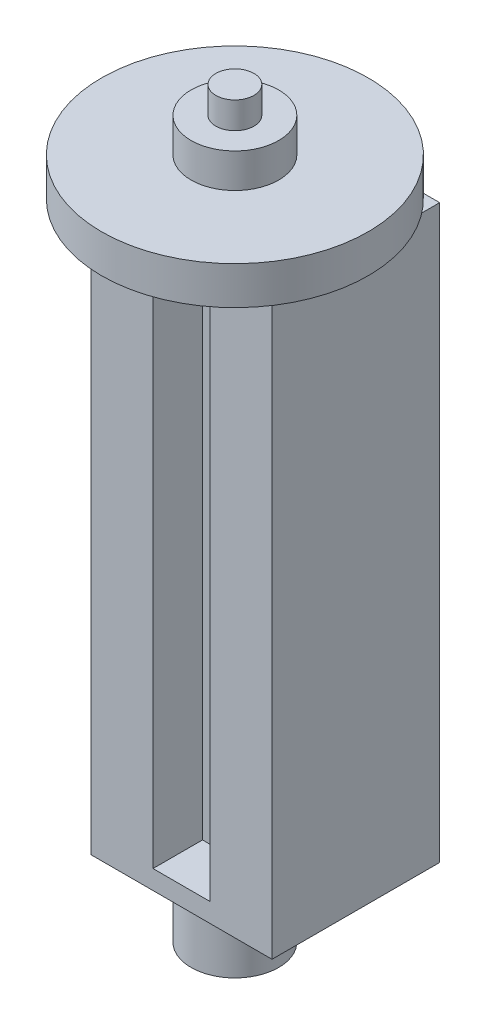
ISO-10303-21;
HEADER;
FILE_DESCRIPTION(('STEP AP214'),'2;1');
FILE_NAME('part.step','',(''),(''),'','','');
FILE_SCHEMA(('AUTOMOTIVE_DESIGN { 1 0 10303 214 1 1 1 1 }'));
ENDSEC;
DATA;
#1=APPLICATION_CONTEXT('core data for automotive mechanical design processes');
#2=APPLICATION_PROTOCOL_DEFINITION('international standard','automotive_design',2000,#1);
#3=PRODUCT_CONTEXT('',#1,'mechanical');
#4=PRODUCT('Part','Part','',(#3));
#5=PRODUCT_RELATED_PRODUCT_CATEGORY('part','',(#4));
#6=PRODUCT_DEFINITION_FORMATION('','',#4);
#7=PRODUCT_DEFINITION_CONTEXT('part definition',#1,'design');
#8=PRODUCT_DEFINITION('design','',#6,#7);
#9=PRODUCT_DEFINITION_SHAPE('','',#8);
#10=(LENGTH_UNIT() NAMED_UNIT(*) SI_UNIT(.MILLI.,.METRE.));
#11=(NAMED_UNIT(*) PLANE_ANGLE_UNIT() SI_UNIT($,.RADIAN.));
#12=(NAMED_UNIT(*) SI_UNIT($,.STERADIAN.) SOLID_ANGLE_UNIT());
#13=UNCERTAINTY_MEASURE_WITH_UNIT(LENGTH_MEASURE(1.E-05),#10,'distance_accuracy_value','');
#14=(GEOMETRIC_REPRESENTATION_CONTEXT(3) GLOBAL_UNCERTAINTY_ASSIGNED_CONTEXT((#13)) GLOBAL_UNIT_ASSIGNED_CONTEXT((#10,
#11,#12)) REPRESENTATION_CONTEXT('',''));
#15=CARTESIAN_POINT('',(0.,0.,0.));
#16=DIRECTION('',(0.,0.,1.));
#17=DIRECTION('',(1.,0.,0.));
#18=AXIS2_PLACEMENT_3D('',#15,#16,#17);
#19=CARTESIAN_POINT('',(0.,16.7526911934581,3.));
#20=DIRECTION('',(0.,-1.,0.));
#21=DIRECTION('',(0.,0.,-1.));
#22=AXIS2_PLACEMENT_3D('',#19,#20,#21);
#23=CYLINDRICAL_SURFACE('',#22,1.15);
#24=CARTESIAN_POINT('',(0.,8.90000000000001,3.));
#25=DIRECTION('',(0.,1.,0.));
#26=DIRECTION('',(0.,0.,1.));
#27=AXIS2_PLACEMENT_3D('',#24,#25,#26);
#28=CIRCLE('',#27,1.15);
#29=CARTESIAN_POINT('',(0.,8.90000000000001,4.15));
#30=VERTEX_POINT('',#29);
#31=EDGE_CURVE('E12',#30,#30,#28,.F.);
#32=ORIENTED_EDGE('',*,*,#31,.F.);
#33=EDGE_LOOP('',(#32));
#34=FACE_BOUND('',#33,.T.);
#35=CARTESIAN_POINT('',(0.,9.80000000000001,3.));
#36=DIRECTION('',(0.,1.,0.));
#37=DIRECTION('',(0.,0.,1.));
#38=AXIS2_PLACEMENT_3D('',#35,#36,#37);
#39=CIRCLE('',#38,1.15);
#40=CARTESIAN_POINT('',(0.,9.80000000000001,4.15));
#41=VERTEX_POINT('',#40);
#42=EDGE_CURVE('E152',#41,#41,#39,.T.);
#43=ORIENTED_EDGE('',*,*,#42,.F.);
#44=EDGE_LOOP('',(#43));
#45=FACE_BOUND('',#44,.T.);
#46=ADVANCED_FACE('F36',(#34,#45),#23,.T.);
#47=CARTESIAN_POINT('',(0.,7.50000000000001,3.));
#48=DIRECTION('',(0.,1.,0.));
#49=DIRECTION('',(0.,0.,1.));
#50=AXIS2_PLACEMENT_3D('',#47,#48,#49);
#51=CIRCLE('',#50,1.15);
#52=CARTESIAN_POINT('',(0.,7.50000000000001,4.15));
#53=VERTEX_POINT('',#52);
#54=EDGE_CURVE('E45',#53,#53,#51,.T.);
#55=ORIENTED_EDGE('',*,*,#54,.T.);
#56=EDGE_LOOP('',(#55));
#57=FACE_BOUND('',#56,.T.);
#58=CARTESIAN_POINT('',(0.,7.9,3.));
#59=DIRECTION('',(0.,1.,0.));
#60=DIRECTION('',(0.,0.,1.));
#61=AXIS2_PLACEMENT_3D('',#58,#59,#60);
#62=CIRCLE('',#61,1.15);
#63=CARTESIAN_POINT('',(0.,7.9,4.15));
#64=VERTEX_POINT('',#63);
#65=EDGE_CURVE('E40',#64,#64,#62,.F.);
#66=ORIENTED_EDGE('',*,*,#65,.T.);
#67=EDGE_LOOP('',(#66));
#68=FACE_BOUND('',#67,.T.);
#69=ADVANCED_FACE('F207',(#57,#68),#23,.T.);
#70=CARTESIAN_POINT('',(-2.37500000000001,7.50000000000001,4.4));
#71=DIRECTION('',(0.,1.,0.));
#72=DIRECTION('',(0.,0.,1.));
#73=AXIS2_PLACEMENT_3D('',#70,#71,#72);
#74=PLANE('',#73);
#75=ORIENTED_EDGE('',*,*,#54,.F.);
#76=EDGE_LOOP('',(#75));
#77=FACE_BOUND('',#76,.T.);
#78=DIRECTION('',(1.,0.,0.));
#79=VECTOR('',#78,1.);
#80=CARTESIAN_POINT('',(-2.37500000000001,7.50000000000001,0.));
#81=LINE('',#80,#79);
#82=CARTESIAN_POINT('',(-2.37500000000001,7.50000000000001,0.));
#83=VERTEX_POINT('',#82);
#84=CARTESIAN_POINT('',(2.375,7.50000000000001,0.));
#85=VERTEX_POINT('',#84);
#86=EDGE_CURVE('E178',#83,#85,#81,.T.);
#87=ORIENTED_EDGE('',*,*,#86,.F.);
#88=DIRECTION('',(0.,0.,-1.));
#89=VECTOR('',#88,1.);
#90=CARTESIAN_POINT('',(-2.37500000000001,7.50000000000001,4.4));
#91=LINE('',#90,#89);
#92=CARTESIAN_POINT('',(-2.37500000000001,7.50000000000001,4.4));
#93=VERTEX_POINT('',#92);
#94=EDGE_CURVE('E61',#93,#83,#91,.T.);
#95=ORIENTED_EDGE('',*,*,#94,.F.);
#96=DIRECTION('',(1.,0.,0.));
#97=VECTOR('',#96,1.);
#98=CARTESIAN_POINT('',(-2.37500000000001,7.50000000000001,4.4));
#99=LINE('',#98,#97);
#100=CARTESIAN_POINT('',(2.375,7.50000000000001,4.4));
#101=VERTEX_POINT('',#100);
#102=EDGE_CURVE('E169',#93,#101,#99,.T.);
#103=ORIENTED_EDGE('',*,*,#102,.T.);
#104=DIRECTION('',(0.,0.,-1.));
#105=VECTOR('',#104,1.);
#106=CARTESIAN_POINT('',(2.375,7.50000000000001,4.4));
#107=LINE('',#106,#105);
#108=EDGE_CURVE('E86',#101,#85,#107,.T.);
#109=ORIENTED_EDGE('',*,*,#108,.T.);
#110=EDGE_LOOP('',(#87,#95,#103,#109));
#111=FACE_BOUND('',#110,.T.);
#112=ADVANCED_FACE('F38',(#77,#111),#74,.T.);
#113=CARTESIAN_POINT('',(-2.37500000000001,7.50000000000001,4.4));
#114=DIRECTION('',(1.,0.,0.));
#115=DIRECTION('',(0.,0.,-1.));
#116=AXIS2_PLACEMENT_3D('',#113,#114,#115);
#117=PLANE('',#116);
#118=DIRECTION('',(0.,-1.,0.));
#119=VECTOR('',#118,1.);
#120=CARTESIAN_POINT('',(-2.37500000000001,7.50000000000001,0.));
#121=LINE('',#120,#119);
#122=CARTESIAN_POINT('',(-2.37500000000001,-7.49999999999999,0.));
#123=VERTEX_POINT('',#122);
#124=EDGE_CURVE('E172',#83,#123,#121,.T.);
#125=ORIENTED_EDGE('',*,*,#124,.T.);
#126=DIRECTION('',(0.,0.,-1.));
#127=VECTOR('',#126,1.);
#128=CARTESIAN_POINT('',(-2.37500000000001,-7.49999999999999,4.4));
#129=LINE('',#128,#127);
#130=CARTESIAN_POINT('',(-2.37500000000001,-7.49999999999999,4.4));
#131=VERTEX_POINT('',#130);
#132=EDGE_CURVE('E189',#131,#123,#129,.T.);
#133=ORIENTED_EDGE('',*,*,#132,.F.);
#134=DIRECTION('',(0.,-1.,0.));
#135=VECTOR('',#134,1.);
#136=CARTESIAN_POINT('',(-2.37500000000001,7.50000000000001,4.4));
#137=LINE('',#136,#135);
#138=EDGE_CURVE('E176',#93,#131,#137,.T.);
#139=ORIENTED_EDGE('',*,*,#138,.F.);
#140=ORIENTED_EDGE('',*,*,#94,.T.);
#141=EDGE_LOOP('',(#125,#133,#139,#140));
#142=FACE_BOUND('',#141,.T.);
#143=ADVANCED_FACE('F227',(#142),#117,.F.);
#144=CARTESIAN_POINT('',(-2.37500000000001,-7.49999999999999,4.4));
#145=DIRECTION('',(0.,1.,0.));
#146=DIRECTION('',(0.,0.,1.));
#147=AXIS2_PLACEMENT_3D('',#144,#145,#146);
#148=PLANE('',#147);
#149=CARTESIAN_POINT('',(0.,-7.49999999999999,3.));
#150=DIRECTION('',(0.,1.,0.));
#151=DIRECTION('',(0.,0.,1.));
#152=AXIS2_PLACEMENT_3D('',#149,#150,#151);
#153=CIRCLE('',#152,1.15);
#154=CARTESIAN_POINT('',(0.,-7.49999999999999,4.15));
#155=VERTEX_POINT('',#154);
#156=EDGE_CURVE('E166',#155,#155,#153,.T.);
#157=ORIENTED_EDGE('',*,*,#156,.T.);
#158=EDGE_LOOP('',(#157));
#159=FACE_BOUND('',#158,.T.);
#160=DIRECTION('',(1.,0.,0.));
#161=VECTOR('',#160,1.);
#162=CARTESIAN_POINT('',(-2.37500000000001,-7.49999999999999,0.));
#163=LINE('',#162,#161);
#164=CARTESIAN_POINT('',(2.375,-7.49999999999999,0.));
#165=VERTEX_POINT('',#164);
#166=EDGE_CURVE('E184',#123,#165,#163,.T.);
#167=ORIENTED_EDGE('',*,*,#166,.T.);
#168=DIRECTION('',(0.,0.,-1.));
#169=VECTOR('',#168,1.);
#170=CARTESIAN_POINT('',(2.375,-7.49999999999999,4.4));
#171=LINE('',#170,#169);
#172=CARTESIAN_POINT('',(2.375,-7.49999999999999,4.4));
#173=VERTEX_POINT('',#172);
#174=EDGE_CURVE('E192',#173,#165,#171,.T.);
#175=ORIENTED_EDGE('',*,*,#174,.F.);
#176=DIRECTION('',(1.,0.,0.));
#177=VECTOR('',#176,1.);
#178=CARTESIAN_POINT('',(-2.37500000000001,-7.49999999999999,4.4));
#179=LINE('',#178,#177);
#180=EDGE_CURVE('E174',#131,#173,#179,.T.);
#181=ORIENTED_EDGE('',*,*,#180,.F.);
#182=ORIENTED_EDGE('',*,*,#132,.T.);
#183=EDGE_LOOP('',(#167,#175,#181,#182));
#184=FACE_BOUND('',#183,.T.);
#185=ADVANCED_FACE('F198',(#159,#184),#148,.F.);
#186=CARTESIAN_POINT('',(2.375,7.50000000000001,4.4));
#187=DIRECTION('',(1.,0.,0.));
#188=DIRECTION('',(0.,1.,0.));
#189=AXIS2_PLACEMENT_3D('',#186,#187,#188);
#190=PLANE('',#189);
#191=DIRECTION('',(0.,-1.,0.));
#192=VECTOR('',#191,1.);
#193=CARTESIAN_POINT('',(2.375,7.50000000000001,0.));
#194=LINE('',#193,#192);
#195=EDGE_CURVE('E181',#85,#165,#194,.T.);
#196=ORIENTED_EDGE('',*,*,#195,.F.);
#197=ORIENTED_EDGE('',*,*,#108,.F.);
#198=DIRECTION('',(0.,-1.,0.));
#199=VECTOR('',#198,1.);
#200=CARTESIAN_POINT('',(2.375,7.50000000000001,4.4));
#201=LINE('',#200,#199);
#202=EDGE_CURVE('E171',#101,#173,#201,.T.);
#203=ORIENTED_EDGE('',*,*,#202,.T.);
#204=ORIENTED_EDGE('',*,*,#174,.T.);
#205=EDGE_LOOP('',(#196,#197,#203,#204));
#206=FACE_BOUND('',#205,.T.);
#207=ADVANCED_FACE('F352',(#206),#190,.T.);
#208=CARTESIAN_POINT('',(0.,0.,4.4));
#209=DIRECTION('',(0.,0.,-1.));
#210=DIRECTION('',(-1.,0.,0.));
#211=AXIS2_PLACEMENT_3D('',#208,#209,#210);
#212=PLANE('',#211);
#213=DIRECTION('',(-1.,0.,0.));
#214=VECTOR('',#213,1.);
#215=CARTESIAN_POINT('',(-0.750000000000001,7.,4.4));
#216=LINE('',#215,#214);
#217=CARTESIAN_POINT('',(0.749999999999999,7.,4.4));
#218=VERTEX_POINT('',#217);
#219=CARTESIAN_POINT('',(-0.750000000000001,7.,4.4));
#220=VERTEX_POINT('',#219);
#221=EDGE_CURVE('E139',#218,#220,#216,.T.);
#222=ORIENTED_EDGE('',*,*,#221,.F.);
#223=DIRECTION('',(0.,1.,0.));
#224=VECTOR('',#223,1.);
#225=CARTESIAN_POINT('',(0.749999999999999,7.,4.4));
#226=LINE('',#225,#224);
#227=CARTESIAN_POINT('',(0.750000000000001,-7.,4.4));
#228=VERTEX_POINT('',#227);
#229=EDGE_CURVE('E52',#228,#218,#226,.T.);
#230=ORIENTED_EDGE('',*,*,#229,.F.);
#231=DIRECTION('',(1.,0.,0.));
#232=VECTOR('',#231,1.);
#233=CARTESIAN_POINT('',(-0.749999999999999,-7.,4.4));
#234=LINE('',#233,#232);
#235=CARTESIAN_POINT('',(-0.749999999999999,-7.,4.4));
#236=VERTEX_POINT('',#235);
#237=EDGE_CURVE('E130',#236,#228,#234,.T.);
#238=ORIENTED_EDGE('',*,*,#237,.F.);
#239=DIRECTION('',(0.,-1.,0.));
#240=VECTOR('',#239,1.);
#241=CARTESIAN_POINT('',(-0.750000000000001,7.,4.4));
#242=LINE('',#241,#240);
#243=EDGE_CURVE('E133',#220,#236,#242,.T.);
#244=ORIENTED_EDGE('',*,*,#243,.F.);
#245=EDGE_LOOP('',(#222,#230,#238,#244));
#246=FACE_BOUND('',#245,.T.);
#247=ORIENTED_EDGE('',*,*,#102,.F.);
#248=ORIENTED_EDGE('',*,*,#138,.T.);
#249=ORIENTED_EDGE('',*,*,#180,.T.);
#250=ORIENTED_EDGE('',*,*,#202,.F.);
#251=EDGE_LOOP('',(#247,#248,#249,#250));
#252=FACE_BOUND('',#251,.T.);
#253=ADVANCED_FACE('F369',(#246,#252),#212,.F.);
#254=CARTESIAN_POINT('',(0.,0.,0.));
#255=DIRECTION('',(0.,0.,-1.));
#256=DIRECTION('',(-1.,0.,0.));
#257=AXIS2_PLACEMENT_3D('',#254,#255,#256);
#258=PLANE('',#257);
#259=ORIENTED_EDGE('',*,*,#86,.T.);
#260=ORIENTED_EDGE('',*,*,#195,.T.);
#261=ORIENTED_EDGE('',*,*,#166,.F.);
#262=ORIENTED_EDGE('',*,*,#124,.F.);
#263=EDGE_LOOP('',(#259,#260,#261,#262));
#264=FACE_BOUND('',#263,.T.);
#265=ADVANCED_FACE('F215',(#264),#258,.T.);
#266=CARTESIAN_POINT('',(0.,-8.99999999999999,3.));
#267=DIRECTION('',(0.,-1.,0.));
#268=DIRECTION('',(0.,0.,-1.));
#269=AXIS2_PLACEMENT_3D('',#266,#267,#268);
#270=PLANE('',#269);
#271=CARTESIAN_POINT('',(0.,-8.99999999999999,3.));
#272=DIRECTION('',(0.,-1.,0.));
#273=DIRECTION('',(0.,0.,-1.));
#274=AXIS2_PLACEMENT_3D('',#271,#272,#273);
#275=CIRCLE('',#274,1.15);
#276=CARTESIAN_POINT('',(0.,-8.99999999999999,1.85));
#277=VERTEX_POINT('',#276);
#278=EDGE_CURVE('E163',#277,#277,#275,.T.);
#279=ORIENTED_EDGE('',*,*,#278,.T.);
#280=EDGE_LOOP('',(#279));
#281=FACE_BOUND('',#280,.T.);
#282=ADVANCED_FACE('F204',(#281),#270,.T.);
#283=ORIENTED_EDGE('',*,*,#278,.F.);
#284=EDGE_LOOP('',(#283));
#285=FACE_BOUND('',#284,.T.);
#286=ORIENTED_EDGE('',*,*,#156,.F.);
#287=EDGE_LOOP('',(#286));
#288=FACE_BOUND('',#287,.T.);
#289=ADVANCED_FACE('F201',(#285,#288),#23,.T.);
#290=CARTESIAN_POINT('',(0.,7.9,3.));
#291=DIRECTION('',(0.,1.,0.));
#292=DIRECTION('',(0.,0.,1.));
#293=AXIS2_PLACEMENT_3D('',#290,#291,#292);
#294=CYLINDRICAL_SURFACE('',#293,3.5);
#295=CARTESIAN_POINT('',(0.,7.9,3.));
#296=DIRECTION('',(0.,1.,0.));
#297=DIRECTION('',(0.,0.,1.));
#298=AXIS2_PLACEMENT_3D('',#295,#296,#297);
#299=CIRCLE('',#298,3.5);
#300=CARTESIAN_POINT('',(0.,7.9,6.5));
#301=VERTEX_POINT('',#300);
#302=EDGE_CURVE('E158',#301,#301,#299,.T.);
#303=ORIENTED_EDGE('',*,*,#302,.T.);
#304=EDGE_LOOP('',(#303));
#305=FACE_BOUND('',#304,.T.);
#306=CARTESIAN_POINT('',(0.,8.90000000000001,3.));
#307=DIRECTION('',(0.,1.,0.));
#308=DIRECTION('',(0.,0.,1.));
#309=AXIS2_PLACEMENT_3D('',#306,#307,#308);
#310=CIRCLE('',#309,3.5);
#311=CARTESIAN_POINT('',(0.,8.90000000000001,6.5));
#312=VERTEX_POINT('',#311);
#313=EDGE_CURVE('E157',#312,#312,#310,.T.);
#314=ORIENTED_EDGE('',*,*,#313,.F.);
#315=EDGE_LOOP('',(#314));
#316=FACE_BOUND('',#315,.T.);
#317=ADVANCED_FACE('F203',(#305,#316),#294,.T.);
#318=CARTESIAN_POINT('',(0.,7.9,3.));
#319=DIRECTION('',(0.,1.,0.));
#320=DIRECTION('',(0.,0.,1.));
#321=AXIS2_PLACEMENT_3D('',#318,#319,#320);
#322=PLANE('',#321);
#323=ORIENTED_EDGE('',*,*,#65,.F.);
#324=EDGE_LOOP('',(#323));
#325=FACE_BOUND('',#324,.T.);
#326=ORIENTED_EDGE('',*,*,#302,.F.);
#327=EDGE_LOOP('',(#326));
#328=FACE_BOUND('',#327,.T.);
#329=ADVANCED_FACE('F212',(#325,#328),#322,.F.);
#330=CARTESIAN_POINT('',(0.,8.90000000000001,3.));
#331=DIRECTION('',(0.,1.,0.));
#332=DIRECTION('',(0.,0.,1.));
#333=AXIS2_PLACEMENT_3D('',#330,#331,#332);
#334=PLANE('',#333);
#335=ORIENTED_EDGE('',*,*,#31,.T.);
#336=EDGE_LOOP('',(#335));
#337=FACE_BOUND('',#336,.T.);
#338=ORIENTED_EDGE('',*,*,#313,.T.);
#339=EDGE_LOOP('',(#338));
#340=FACE_BOUND('',#339,.T.);
#341=ADVANCED_FACE('F236',(#337,#340),#334,.T.);
#342=CARTESIAN_POINT('',(0.,9.80000000000001,3.));
#343=DIRECTION('',(0.,1.,0.));
#344=DIRECTION('',(0.,0.,1.));
#345=AXIS2_PLACEMENT_3D('',#342,#343,#344);
#346=PLANE('',#345);
#347=CARTESIAN_POINT('',(0.,9.80000000000001,3.));
#348=DIRECTION('',(0.,1.,0.));
#349=DIRECTION('',(0.,0.,1.));
#350=AXIS2_PLACEMENT_3D('',#347,#348,#349);
#351=CIRCLE('',#350,0.5);
#352=CARTESIAN_POINT('',(0.,9.80000000000001,3.5));
#353=VERTEX_POINT('',#352);
#354=EDGE_CURVE('E149',#353,#353,#351,.T.);
#355=ORIENTED_EDGE('',*,*,#354,.F.);
#356=EDGE_LOOP('',(#355));
#357=FACE_BOUND('',#356,.T.);
#358=ORIENTED_EDGE('',*,*,#42,.T.);
#359=EDGE_LOOP('',(#358));
#360=FACE_BOUND('',#359,.T.);
#361=ADVANCED_FACE('F243',(#357,#360),#346,.T.);
#362=CARTESIAN_POINT('',(0.,9.80000000000001,3.));
#363=DIRECTION('',(0.,1.,0.));
#364=DIRECTION('',(0.,0.,1.));
#365=AXIS2_PLACEMENT_3D('',#362,#363,#364);
#366=CYLINDRICAL_SURFACE('',#365,0.5);
#367=ORIENTED_EDGE('',*,*,#354,.T.);
#368=EDGE_LOOP('',(#367));
#369=FACE_BOUND('',#368,.T.);
#370=CARTESIAN_POINT('',(0.,10.5,3.));
#371=DIRECTION('',(0.,1.,0.));
#372=DIRECTION('',(0.,0.,1.));
#373=AXIS2_PLACEMENT_3D('',#370,#371,#372);
#374=CIRCLE('',#373,0.5);
#375=CARTESIAN_POINT('',(0.,10.5,3.5));
#376=VERTEX_POINT('',#375);
#377=EDGE_CURVE('E145',#376,#376,#374,.T.);
#378=ORIENTED_EDGE('',*,*,#377,.F.);
#379=EDGE_LOOP('',(#378));
#380=FACE_BOUND('',#379,.T.);
#381=ADVANCED_FACE('F249',(#369,#380),#366,.T.);
#382=CARTESIAN_POINT('',(-2.37500000000001,10.5,4.4));
#383=DIRECTION('',(0.,1.,0.));
#384=DIRECTION('',(0.,0.,1.));
#385=AXIS2_PLACEMENT_3D('',#382,#383,#384);
#386=PLANE('',#385);
#387=ORIENTED_EDGE('',*,*,#377,.T.);
#388=EDGE_LOOP('',(#387));
#389=FACE_BOUND('',#388,.T.);
#390=ADVANCED_FACE('F255',(#389),#386,.T.);
#391=CARTESIAN_POINT('',(0.749999999999999,7.,3.1));
#392=DIRECTION('',(1.,0.,0.));
#393=DIRECTION('',(0.,1.,0.));
#394=AXIS2_PLACEMENT_3D('',#391,#392,#393);
#395=PLANE('',#394);
#396=ORIENTED_EDGE('',*,*,#229,.T.);
#397=DIRECTION('',(0.,0.,1.));
#398=VECTOR('',#397,1.);
#399=CARTESIAN_POINT('',(0.749999999999999,7.,3.1));
#400=LINE('',#399,#398);
#401=CARTESIAN_POINT('',(0.749999999999999,7.,3.1));
#402=VERTEX_POINT('',#401);
#403=EDGE_CURVE('E108',#402,#218,#400,.T.);
#404=ORIENTED_EDGE('',*,*,#403,.F.);
#405=DIRECTION('',(0.,1.,0.));
#406=VECTOR('',#405,1.);
#407=CARTESIAN_POINT('',(0.749999999999999,7.,3.1));
#408=LINE('',#407,#406);
#409=CARTESIAN_POINT('',(0.750000000000001,-7.,3.1));
#410=VERTEX_POINT('',#409);
#411=EDGE_CURVE('E112',#410,#402,#408,.T.);
#412=ORIENTED_EDGE('',*,*,#411,.F.);
#413=DIRECTION('',(0.,0.,1.));
#414=VECTOR('',#413,1.);
#415=CARTESIAN_POINT('',(0.750000000000001,-7.,3.1));
#416=LINE('',#415,#414);
#417=EDGE_CURVE('E143',#410,#228,#416,.T.);
#418=ORIENTED_EDGE('',*,*,#417,.T.);
#419=EDGE_LOOP('',(#396,#404,#412,#418));
#420=FACE_BOUND('',#419,.T.);
#421=ADVANCED_FACE('F110',(#420),#395,.F.);
#422=CARTESIAN_POINT('',(-0.749999999999999,-7.,3.1));
#423=DIRECTION('',(0.,-1.,0.));
#424=DIRECTION('',(0.,0.,-1.));
#425=AXIS2_PLACEMENT_3D('',#422,#423,#424);
#426=PLANE('',#425);
#427=ORIENTED_EDGE('',*,*,#237,.T.);
#428=ORIENTED_EDGE('',*,*,#417,.F.);
#429=DIRECTION('',(1.,0.,0.));
#430=VECTOR('',#429,1.);
#431=CARTESIAN_POINT('',(-0.749999999999999,-7.,3.1));
#432=LINE('',#431,#430);
#433=CARTESIAN_POINT('',(-0.749999999999999,-7.,3.1));
#434=VERTEX_POINT('',#433);
#435=EDGE_CURVE('E118',#434,#410,#432,.T.);
#436=ORIENTED_EDGE('',*,*,#435,.F.);
#437=DIRECTION('',(0.,0.,1.));
#438=VECTOR('',#437,1.);
#439=CARTESIAN_POINT('',(-0.749999999999999,-7.,3.1));
#440=LINE('',#439,#438);
#441=EDGE_CURVE('E146',#434,#236,#440,.T.);
#442=ORIENTED_EDGE('',*,*,#441,.T.);
#443=EDGE_LOOP('',(#427,#428,#436,#442));
#444=FACE_BOUND('',#443,.T.);
#445=ADVANCED_FACE('F259',(#444),#426,.F.);
#446=CARTESIAN_POINT('',(-0.750000000000001,7.,3.1));
#447=DIRECTION('',(-1.,0.,0.));
#448=DIRECTION('',(0.,-1.,0.));
#449=AXIS2_PLACEMENT_3D('',#446,#447,#448);
#450=PLANE('',#449);
#451=ORIENTED_EDGE('',*,*,#243,.T.);
#452=ORIENTED_EDGE('',*,*,#441,.F.);
#453=DIRECTION('',(0.,-1.,0.));
#454=VECTOR('',#453,1.);
#455=CARTESIAN_POINT('',(-0.750000000000001,7.,3.1));
#456=LINE('',#455,#454);
#457=CARTESIAN_POINT('',(-0.750000000000001,7.,3.1));
#458=VERTEX_POINT('',#457);
#459=EDGE_CURVE('E126',#458,#434,#456,.T.);
#460=ORIENTED_EDGE('',*,*,#459,.F.);
#461=DIRECTION('',(0.,0.,1.));
#462=VECTOR('',#461,1.);
#463=CARTESIAN_POINT('',(-0.750000000000001,7.,3.1));
#464=LINE('',#463,#462);
#465=EDGE_CURVE('E117',#458,#220,#464,.T.);
#466=ORIENTED_EDGE('',*,*,#465,.T.);
#467=EDGE_LOOP('',(#451,#452,#460,#466));
#468=FACE_BOUND('',#467,.T.);
#469=ADVANCED_FACE('F262',(#468),#450,.F.);
#470=CARTESIAN_POINT('',(-0.750000000000001,7.,3.1));
#471=DIRECTION('',(0.,1.,0.));
#472=DIRECTION('',(0.,0.,1.));
#473=AXIS2_PLACEMENT_3D('',#470,#471,#472);
#474=PLANE('',#473);
#475=ORIENTED_EDGE('',*,*,#221,.T.);
#476=ORIENTED_EDGE('',*,*,#465,.F.);
#477=DIRECTION('',(-1.,0.,0.));
#478=VECTOR('',#477,1.);
#479=CARTESIAN_POINT('',(-0.750000000000001,7.,3.1));
#480=LINE('',#479,#478);
#481=EDGE_CURVE('E121',#402,#458,#480,.T.);
#482=ORIENTED_EDGE('',*,*,#481,.F.);
#483=ORIENTED_EDGE('',*,*,#403,.T.);
#484=EDGE_LOOP('',(#475,#476,#482,#483));
#485=FACE_BOUND('',#484,.T.);
#486=ADVANCED_FACE('F122',(#485),#474,.F.);
#487=CARTESIAN_POINT('',(0.,0.,3.1));
#488=DIRECTION('',(0.,0.,1.));
#489=DIRECTION('',(1.,0.,0.));
#490=AXIS2_PLACEMENT_3D('',#487,#488,#489);
#491=PLANE('',#490);
#492=ORIENTED_EDGE('',*,*,#411,.T.);
#493=ORIENTED_EDGE('',*,*,#481,.T.);
#494=ORIENTED_EDGE('',*,*,#459,.T.);
#495=ORIENTED_EDGE('',*,*,#435,.T.);
#496=EDGE_LOOP('',(#492,#493,#494,#495));
#497=FACE_BOUND('',#496,.T.);
#498=ADVANCED_FACE('F128',(#497),#491,.T.);
#499=CLOSED_SHELL('',(#46,#69,#112,#143,#185,#207,#253,#265,#282,#289,#317,#329,#341,#361,#381,
#390,#421,#445,#469,#486,#498));
#500=MANIFOLD_SOLID_BREP('B2',#499);
#501=ADVANCED_BREP_SHAPE_REPRESENTATION('',(#18,#500),#14);
#502=SHAPE_DEFINITION_REPRESENTATION(#9,#501);
ENDSEC;
END-ISO-10303-21;
